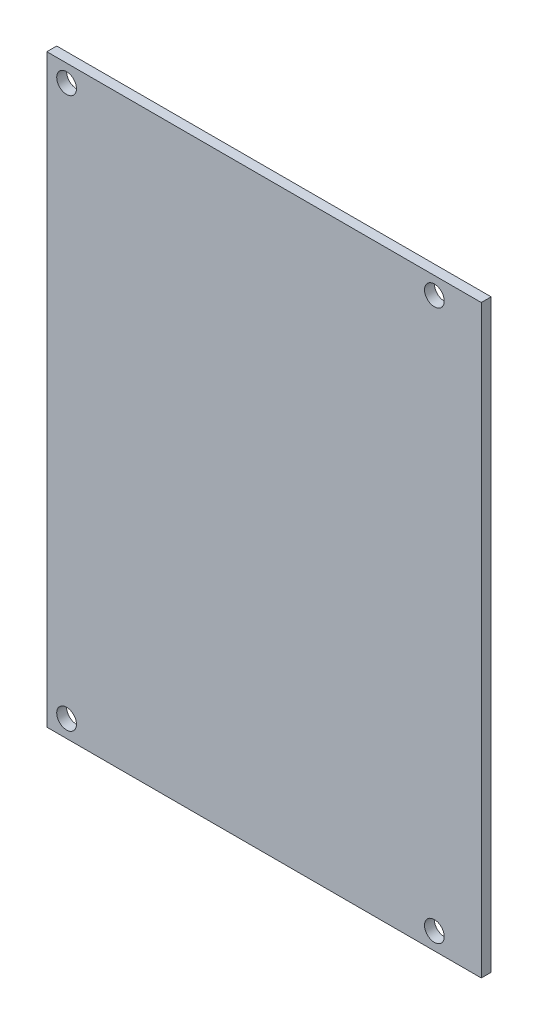
ISO-10303-21;
HEADER;
FILE_DESCRIPTION(('STEP AP214'),'2;1');
FILE_NAME('part.step','',(''),(''),'','','');
FILE_SCHEMA(('AUTOMOTIVE_DESIGN { 1 0 10303 214 1 1 1 1 }'));
ENDSEC;
DATA;
#1=APPLICATION_CONTEXT('core data for automotive mechanical design processes');
#2=APPLICATION_PROTOCOL_DEFINITION('international standard','automotive_design',2000,#1);
#3=PRODUCT_CONTEXT('',#1,'mechanical');
#4=PRODUCT('Part','Part','',(#3));
#5=PRODUCT_RELATED_PRODUCT_CATEGORY('part','',(#4));
#6=PRODUCT_DEFINITION_FORMATION('','',#4);
#7=PRODUCT_DEFINITION_CONTEXT('part definition',#1,'design');
#8=PRODUCT_DEFINITION('design','',#6,#7);
#9=PRODUCT_DEFINITION_SHAPE('','',#8);
#10=(LENGTH_UNIT() NAMED_UNIT(*) SI_UNIT(.MILLI.,.METRE.));
#11=(NAMED_UNIT(*) PLANE_ANGLE_UNIT() SI_UNIT($,.RADIAN.));
#12=(NAMED_UNIT(*) SI_UNIT($,.STERADIAN.) SOLID_ANGLE_UNIT());
#13=UNCERTAINTY_MEASURE_WITH_UNIT(LENGTH_MEASURE(1.E-05),#10,'distance_accuracy_value','');
#14=(GEOMETRIC_REPRESENTATION_CONTEXT(3) GLOBAL_UNCERTAINTY_ASSIGNED_CONTEXT((#13)) GLOBAL_UNIT_ASSIGNED_CONTEXT((#10,
#11,#12)) REPRESENTATION_CONTEXT('',''));
#15=CARTESIAN_POINT('',(0.,0.,0.));
#16=DIRECTION('',(0.,0.,1.));
#17=DIRECTION('',(1.,0.,0.));
#18=AXIS2_PLACEMENT_3D('',#15,#16,#17);
#19=CARTESIAN_POINT('',(-44.,-59.25,2.));
#20=DIRECTION('',(1.,0.,0.));
#21=DIRECTION('',(0.,0.,-1.));
#22=AXIS2_PLACEMENT_3D('',#19,#20,#21);
#23=PLANE('',#22);
#24=DIRECTION('',(0.,-1.,0.));
#25=VECTOR('',#24,1.);
#26=CARTESIAN_POINT('',(-44.,-59.25,0.));
#27=LINE('',#26,#25);
#28=CARTESIAN_POINT('',(-44.,59.25,0.));
#29=VERTEX_POINT('',#28);
#30=CARTESIAN_POINT('',(-44.,-59.25,0.));
#31=VERTEX_POINT('',#30);
#32=EDGE_CURVE('E97',#29,#31,#27,.T.);
#33=ORIENTED_EDGE('',*,*,#32,.T.);
#34=DIRECTION('',(0.,0.,-1.));
#35=VECTOR('',#34,1.);
#36=CARTESIAN_POINT('',(-44.,-59.25,2.));
#37=LINE('',#36,#35);
#38=CARTESIAN_POINT('',(-44.,-59.25,2.));
#39=VERTEX_POINT('',#38);
#40=EDGE_CURVE('E11',#39,#31,#37,.T.);
#41=ORIENTED_EDGE('',*,*,#40,.F.);
#42=DIRECTION('',(0.,-1.,0.));
#43=VECTOR('',#42,1.);
#44=CARTESIAN_POINT('',(-44.,-59.25,2.));
#45=LINE('',#44,#43);
#46=CARTESIAN_POINT('',(-44.,59.25,2.));
#47=VERTEX_POINT('',#46);
#48=EDGE_CURVE('E85',#47,#39,#45,.T.);
#49=ORIENTED_EDGE('',*,*,#48,.F.);
#50=DIRECTION('',(0.,0.,-1.));
#51=VECTOR('',#50,1.);
#52=CARTESIAN_POINT('',(-44.,59.25,2.));
#53=LINE('',#52,#51);
#54=EDGE_CURVE('E93',#47,#29,#53,.T.);
#55=ORIENTED_EDGE('',*,*,#54,.T.);
#56=EDGE_LOOP('',(#33,#41,#49,#55));
#57=FACE_BOUND('',#56,.T.);
#58=ADVANCED_FACE('F34',(#57),#23,.F.);
#59=CARTESIAN_POINT('',(-44.,-59.25,2.));
#60=DIRECTION('',(0.,1.,0.));
#61=DIRECTION('',(0.,0.,1.));
#62=AXIS2_PLACEMENT_3D('',#59,#60,#61);
#63=PLANE('',#62);
#64=DIRECTION('',(1.,0.,0.));
#65=VECTOR('',#64,1.);
#66=CARTESIAN_POINT('',(-44.,-59.25,0.));
#67=LINE('',#66,#65);
#68=CARTESIAN_POINT('',(44.,-59.25,0.));
#69=VERTEX_POINT('',#68);
#70=EDGE_CURVE('E89',#31,#69,#67,.T.);
#71=ORIENTED_EDGE('',*,*,#70,.T.);
#72=DIRECTION('',(0.,0.,-1.));
#73=VECTOR('',#72,1.);
#74=CARTESIAN_POINT('',(44.,-59.25,2.));
#75=LINE('',#74,#73);
#76=CARTESIAN_POINT('',(44.,-59.25,2.));
#77=VERTEX_POINT('',#76);
#78=EDGE_CURVE('E42',#77,#69,#75,.T.);
#79=ORIENTED_EDGE('',*,*,#78,.F.);
#80=DIRECTION('',(1.,0.,0.));
#81=VECTOR('',#80,1.);
#82=CARTESIAN_POINT('',(-44.,-59.25,2.));
#83=LINE('',#82,#81);
#84=EDGE_CURVE('E80',#39,#77,#83,.T.);
#85=ORIENTED_EDGE('',*,*,#84,.F.);
#86=ORIENTED_EDGE('',*,*,#40,.T.);
#87=EDGE_LOOP('',(#71,#79,#85,#86));
#88=FACE_BOUND('',#87,.T.);
#89=ADVANCED_FACE('F88',(#88),#63,.F.);
#90=CARTESIAN_POINT('',(44.,-59.25,2.));
#91=DIRECTION('',(-1.,0.,0.));
#92=DIRECTION('',(0.,0.,1.));
#93=AXIS2_PLACEMENT_3D('',#90,#91,#92);
#94=PLANE('',#93);
#95=DIRECTION('',(0.,1.,0.));
#96=VECTOR('',#95,1.);
#97=CARTESIAN_POINT('',(44.,-59.25,0.));
#98=LINE('',#97,#96);
#99=CARTESIAN_POINT('',(44.,59.25,0.));
#100=VERTEX_POINT('',#99);
#101=EDGE_CURVE('E67',#69,#100,#98,.T.);
#102=ORIENTED_EDGE('',*,*,#101,.T.);
#103=DIRECTION('',(0.,0.,-1.));
#104=VECTOR('',#103,1.);
#105=CARTESIAN_POINT('',(44.,59.25,2.));
#106=LINE('',#105,#104);
#107=CARTESIAN_POINT('',(44.,59.25,2.));
#108=VERTEX_POINT('',#107);
#109=EDGE_CURVE('E90',#108,#100,#106,.T.);
#110=ORIENTED_EDGE('',*,*,#109,.F.);
#111=DIRECTION('',(0.,1.,0.));
#112=VECTOR('',#111,1.);
#113=CARTESIAN_POINT('',(44.,-59.25,2.));
#114=LINE('',#113,#112);
#115=EDGE_CURVE('E83',#77,#108,#114,.T.);
#116=ORIENTED_EDGE('',*,*,#115,.F.);
#117=ORIENTED_EDGE('',*,*,#78,.T.);
#118=EDGE_LOOP('',(#102,#110,#116,#117));
#119=FACE_BOUND('',#118,.T.);
#120=ADVANCED_FACE('F91',(#119),#94,.F.);
#121=CARTESIAN_POINT('',(-44.,59.25,2.));
#122=DIRECTION('',(0.,-1.,0.));
#123=DIRECTION('',(0.,0.,-1.));
#124=AXIS2_PLACEMENT_3D('',#121,#122,#123);
#125=PLANE('',#124);
#126=DIRECTION('',(-1.,0.,0.));
#127=VECTOR('',#126,1.);
#128=CARTESIAN_POINT('',(-44.,59.25,0.));
#129=LINE('',#128,#127);
#130=EDGE_CURVE('E73',#100,#29,#129,.T.);
#131=ORIENTED_EDGE('',*,*,#130,.T.);
#132=ORIENTED_EDGE('',*,*,#54,.F.);
#133=DIRECTION('',(-1.,0.,0.));
#134=VECTOR('',#133,1.);
#135=CARTESIAN_POINT('',(-44.,59.25,2.));
#136=LINE('',#135,#134);
#137=EDGE_CURVE('E50',#108,#47,#136,.T.);
#138=ORIENTED_EDGE('',*,*,#137,.F.);
#139=ORIENTED_EDGE('',*,*,#109,.T.);
#140=EDGE_LOOP('',(#131,#132,#138,#139));
#141=FACE_BOUND('',#140,.T.);
#142=ADVANCED_FACE('F105',(#141),#125,.F.);
#143=CARTESIAN_POINT('',(0.,0.,2.));
#144=DIRECTION('',(0.,0.,-1.));
#145=DIRECTION('',(-1.,0.,0.));
#146=AXIS2_PLACEMENT_3D('',#143,#144,#145);
#147=PLANE('',#146);
#148=CARTESIAN_POINT('',(-40.,-55.75,2.));
#149=DIRECTION('',(0.,0.,1.));
#150=DIRECTION('',(1.,0.,0.));
#151=AXIS2_PLACEMENT_3D('',#148,#149,#150);
#152=CIRCLE('',#151,2.);
#153=CARTESIAN_POINT('',(-38.,-55.75,2.));
#154=VERTEX_POINT('',#153);
#155=EDGE_CURVE('E129',#154,#154,#152,.T.);
#156=ORIENTED_EDGE('',*,*,#155,.F.);
#157=EDGE_LOOP('',(#156));
#158=FACE_BOUND('',#157,.T.);
#159=CARTESIAN_POINT('',(34.5,-55.75,2.));
#160=DIRECTION('',(0.,0.,1.));
#161=DIRECTION('',(1.,0.,0.));
#162=AXIS2_PLACEMENT_3D('',#159,#160,#161);
#163=CIRCLE('',#162,2.);
#164=CARTESIAN_POINT('',(36.5,-55.75,2.));
#165=VERTEX_POINT('',#164);
#166=EDGE_CURVE('E123',#165,#165,#163,.T.);
#167=ORIENTED_EDGE('',*,*,#166,.F.);
#168=EDGE_LOOP('',(#167));
#169=FACE_BOUND('',#168,.T.);
#170=CARTESIAN_POINT('',(34.5,55.75,2.));
#171=DIRECTION('',(0.,0.,1.));
#172=DIRECTION('',(1.,0.,0.));
#173=AXIS2_PLACEMENT_3D('',#170,#171,#172);
#174=CIRCLE('',#173,2.);
#175=CARTESIAN_POINT('',(36.5,55.75,2.));
#176=VERTEX_POINT('',#175);
#177=EDGE_CURVE('E117',#176,#176,#174,.T.);
#178=ORIENTED_EDGE('',*,*,#177,.F.);
#179=EDGE_LOOP('',(#178));
#180=FACE_BOUND('',#179,.T.);
#181=CARTESIAN_POINT('',(-40.,55.75,2.));
#182=DIRECTION('',(0.,0.,1.));
#183=DIRECTION('',(1.,0.,0.));
#184=AXIS2_PLACEMENT_3D('',#181,#182,#183);
#185=CIRCLE('',#184,2.);
#186=CARTESIAN_POINT('',(-38.,55.75,2.));
#187=VERTEX_POINT('',#186);
#188=EDGE_CURVE('E111',#187,#187,#185,.T.);
#189=ORIENTED_EDGE('',*,*,#188,.F.);
#190=EDGE_LOOP('',(#189));
#191=FACE_BOUND('',#190,.T.);
#192=ORIENTED_EDGE('',*,*,#48,.T.);
#193=ORIENTED_EDGE('',*,*,#84,.T.);
#194=ORIENTED_EDGE('',*,*,#115,.T.);
#195=ORIENTED_EDGE('',*,*,#137,.T.);
#196=EDGE_LOOP('',(#192,#193,#194,#195));
#197=FACE_BOUND('',#196,.T.);
#198=ADVANCED_FACE('F81',(#158,#169,#180,#191,#197),#147,.F.);
#199=CARTESIAN_POINT('',(0.,0.,0.));
#200=DIRECTION('',(0.,0.,-1.));
#201=DIRECTION('',(-1.,0.,0.));
#202=AXIS2_PLACEMENT_3D('',#199,#200,#201);
#203=PLANE('',#202);
#204=CARTESIAN_POINT('',(-40.,-55.75,0.));
#205=DIRECTION('',(0.,0.,1.));
#206=DIRECTION('',(1.,0.,0.));
#207=AXIS2_PLACEMENT_3D('',#204,#205,#206);
#208=CIRCLE('',#207,2.);
#209=CARTESIAN_POINT('',(-38.,-55.75,0.));
#210=VERTEX_POINT('',#209);
#211=EDGE_CURVE('E114',#210,#210,#208,.T.);
#212=ORIENTED_EDGE('',*,*,#211,.T.);
#213=EDGE_LOOP('',(#212));
#214=FACE_BOUND('',#213,.T.);
#215=CARTESIAN_POINT('',(34.5,-55.75,0.));
#216=DIRECTION('',(0.,0.,1.));
#217=DIRECTION('',(1.,0.,0.));
#218=AXIS2_PLACEMENT_3D('',#215,#216,#217);
#219=CIRCLE('',#218,2.);
#220=CARTESIAN_POINT('',(36.5,-55.75,0.));
#221=VERTEX_POINT('',#220);
#222=EDGE_CURVE('E126',#221,#221,#219,.T.);
#223=ORIENTED_EDGE('',*,*,#222,.T.);
#224=EDGE_LOOP('',(#223));
#225=FACE_BOUND('',#224,.T.);
#226=CARTESIAN_POINT('',(34.5,55.75,0.));
#227=DIRECTION('',(0.,0.,1.));
#228=DIRECTION('',(1.,0.,0.));
#229=AXIS2_PLACEMENT_3D('',#226,#227,#228);
#230=CIRCLE('',#229,2.);
#231=CARTESIAN_POINT('',(36.5,55.75,0.));
#232=VERTEX_POINT('',#231);
#233=EDGE_CURVE('E120',#232,#232,#230,.T.);
#234=ORIENTED_EDGE('',*,*,#233,.T.);
#235=EDGE_LOOP('',(#234));
#236=FACE_BOUND('',#235,.T.);
#237=CARTESIAN_POINT('',(-40.,55.75,0.));
#238=DIRECTION('',(0.,0.,1.));
#239=DIRECTION('',(1.,0.,0.));
#240=AXIS2_PLACEMENT_3D('',#237,#238,#239);
#241=CIRCLE('',#240,2.);
#242=CARTESIAN_POINT('',(-38.,55.75,0.));
#243=VERTEX_POINT('',#242);
#244=EDGE_CURVE('E100',#243,#243,#241,.T.);
#245=ORIENTED_EDGE('',*,*,#244,.T.);
#246=EDGE_LOOP('',(#245));
#247=FACE_BOUND('',#246,.T.);
#248=ORIENTED_EDGE('',*,*,#32,.F.);
#249=ORIENTED_EDGE('',*,*,#130,.F.);
#250=ORIENTED_EDGE('',*,*,#101,.F.);
#251=ORIENTED_EDGE('',*,*,#70,.F.);
#252=EDGE_LOOP('',(#248,#249,#250,#251));
#253=FACE_BOUND('',#252,.T.);
#254=ADVANCED_FACE('F108',(#214,#225,#236,#247,#253),#203,.T.);
#255=CARTESIAN_POINT('',(-40.,55.75,0.));
#256=DIRECTION('',(0.,0.,1.));
#257=DIRECTION('',(1.,0.,0.));
#258=AXIS2_PLACEMENT_3D('',#255,#256,#257);
#259=CYLINDRICAL_SURFACE('',#258,2.);
#260=ORIENTED_EDGE('',*,*,#244,.F.);
#261=EDGE_LOOP('',(#260));
#262=FACE_BOUND('',#261,.T.);
#263=ORIENTED_EDGE('',*,*,#188,.T.);
#264=EDGE_LOOP('',(#263));
#265=FACE_BOUND('',#264,.T.);
#266=ADVANCED_FACE('F153',(#262,#265),#259,.F.);
#267=CARTESIAN_POINT('',(34.5,55.75,0.));
#268=DIRECTION('',(0.,0.,1.));
#269=DIRECTION('',(1.,0.,0.));
#270=AXIS2_PLACEMENT_3D('',#267,#268,#269);
#271=CYLINDRICAL_SURFACE('',#270,2.);
#272=ORIENTED_EDGE('',*,*,#233,.F.);
#273=EDGE_LOOP('',(#272));
#274=FACE_BOUND('',#273,.T.);
#275=ORIENTED_EDGE('',*,*,#177,.T.);
#276=EDGE_LOOP('',(#275));
#277=FACE_BOUND('',#276,.T.);
#278=ADVANCED_FACE('F155',(#274,#277),#271,.F.);
#279=CARTESIAN_POINT('',(34.5,-55.75,0.));
#280=DIRECTION('',(0.,0.,1.));
#281=DIRECTION('',(1.,0.,0.));
#282=AXIS2_PLACEMENT_3D('',#279,#280,#281);
#283=CYLINDRICAL_SURFACE('',#282,2.);
#284=ORIENTED_EDGE('',*,*,#222,.F.);
#285=EDGE_LOOP('',(#284));
#286=FACE_BOUND('',#285,.T.);
#287=ORIENTED_EDGE('',*,*,#166,.T.);
#288=EDGE_LOOP('',(#287));
#289=FACE_BOUND('',#288,.T.);
#290=ADVANCED_FACE('F140',(#286,#289),#283,.F.);
#291=CARTESIAN_POINT('',(-40.,-55.75,0.));
#292=DIRECTION('',(0.,0.,1.));
#293=DIRECTION('',(1.,0.,0.));
#294=AXIS2_PLACEMENT_3D('',#291,#292,#293);
#295=CYLINDRICAL_SURFACE('',#294,2.);
#296=ORIENTED_EDGE('',*,*,#211,.F.);
#297=EDGE_LOOP('',(#296));
#298=FACE_BOUND('',#297,.T.);
#299=ORIENTED_EDGE('',*,*,#155,.T.);
#300=EDGE_LOOP('',(#299));
#301=FACE_BOUND('',#300,.T.);
#302=ADVANCED_FACE('F137',(#298,#301),#295,.F.);
#303=CLOSED_SHELL('',(#58,#89,#120,#142,#198,#254,#266,#278,#290,#302));
#304=MANIFOLD_SOLID_BREP('B2',#303);
#305=ADVANCED_BREP_SHAPE_REPRESENTATION('',(#18,#304),#14);
#306=SHAPE_DEFINITION_REPRESENTATION(#9,#305);
ENDSEC;
END-ISO-10303-21;
